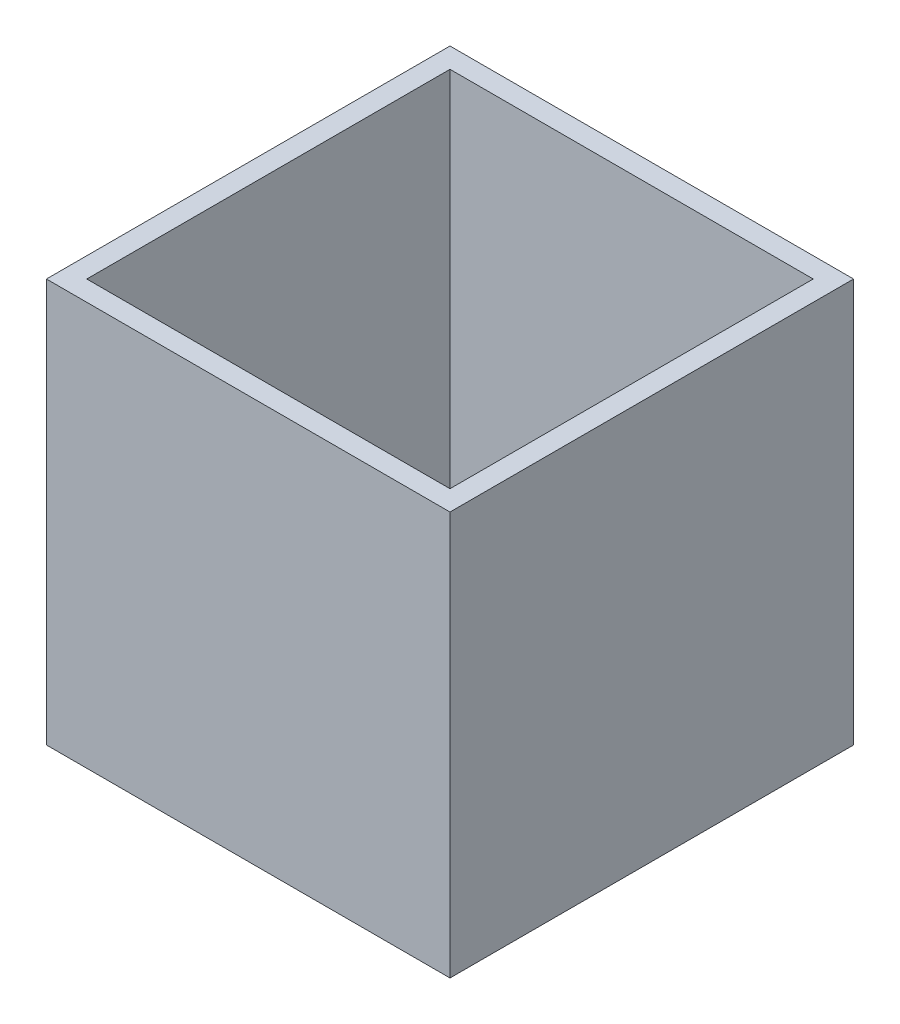
ISO-10303-21;
HEADER;
FILE_DESCRIPTION(('STEP AP214'),'2;1');
FILE_NAME('part.step','',(''),(''),'','','');
FILE_SCHEMA(('AUTOMOTIVE_DESIGN { 1 0 10303 214 1 1 1 1 }'));
ENDSEC;
DATA;
#1=APPLICATION_CONTEXT('core data for automotive mechanical design processes');
#2=APPLICATION_PROTOCOL_DEFINITION('international standard','automotive_design',2000,#1);
#3=PRODUCT_CONTEXT('',#1,'mechanical');
#4=PRODUCT('Part','Part','',(#3));
#5=PRODUCT_RELATED_PRODUCT_CATEGORY('part','',(#4));
#6=PRODUCT_DEFINITION_FORMATION('','',#4);
#7=PRODUCT_DEFINITION_CONTEXT('part definition',#1,'design');
#8=PRODUCT_DEFINITION('design','',#6,#7);
#9=PRODUCT_DEFINITION_SHAPE('','',#8);
#10=(LENGTH_UNIT() NAMED_UNIT(*) SI_UNIT(.MILLI.,.METRE.));
#11=(NAMED_UNIT(*) PLANE_ANGLE_UNIT() SI_UNIT($,.RADIAN.));
#12=(NAMED_UNIT(*) SI_UNIT($,.STERADIAN.) SOLID_ANGLE_UNIT());
#13=UNCERTAINTY_MEASURE_WITH_UNIT(LENGTH_MEASURE(1.E-05),#10,'distance_accuracy_value','');
#14=(GEOMETRIC_REPRESENTATION_CONTEXT(3) GLOBAL_UNCERTAINTY_ASSIGNED_CONTEXT((#13)) GLOBAL_UNIT_ASSIGNED_CONTEXT((#10,
#11,#12)) REPRESENTATION_CONTEXT('',''));
#15=CARTESIAN_POINT('',(0.,0.,0.));
#16=DIRECTION('',(0.,0.,1.));
#17=DIRECTION('',(1.,0.,0.));
#18=AXIS2_PLACEMENT_3D('',#15,#16,#17);
#19=CARTESIAN_POINT('',(0.,40.,0.));
#20=DIRECTION('',(0.,1.,0.));
#21=DIRECTION('',(0.,0.,1.));
#22=AXIS2_PLACEMENT_3D('',#19,#20,#21);
#23=PLANE('',#22);
#24=DIRECTION('',(0.,0.,1.));
#25=VECTOR('',#24,1.);
#26=CARTESIAN_POINT('',(-20.,40.,20.));
#27=LINE('',#26,#25);
#28=CARTESIAN_POINT('',(-20.,40.,-20.));
#29=VERTEX_POINT('',#28);
#30=CARTESIAN_POINT('',(-20.,40.,20.));
#31=VERTEX_POINT('',#30);
#32=EDGE_CURVE('E195',#29,#31,#27,.T.);
#33=ORIENTED_EDGE('',*,*,#32,.T.);
#34=DIRECTION('',(1.,0.,0.));
#35=VECTOR('',#34,1.);
#36=CARTESIAN_POINT('',(20.,40.,20.));
#37=LINE('',#36,#35);
#38=CARTESIAN_POINT('',(20.,40.,20.));
#39=VERTEX_POINT('',#38);
#40=EDGE_CURVE('E199',#31,#39,#37,.T.);
#41=ORIENTED_EDGE('',*,*,#40,.T.);
#42=DIRECTION('',(0.,0.,-1.));
#43=VECTOR('',#42,1.);
#44=CARTESIAN_POINT('',(20.,40.,20.));
#45=LINE('',#44,#43);
#46=CARTESIAN_POINT('',(20.,40.,-20.));
#47=VERTEX_POINT('',#46);
#48=EDGE_CURVE('E203',#39,#47,#45,.T.);
#49=ORIENTED_EDGE('',*,*,#48,.T.);
#50=DIRECTION('',(-1.,0.,0.));
#51=VECTOR('',#50,1.);
#52=CARTESIAN_POINT('',(20.,40.,-20.));
#53=LINE('',#52,#51);
#54=EDGE_CURVE('E206',#47,#29,#53,.T.);
#55=ORIENTED_EDGE('',*,*,#54,.T.);
#56=EDGE_LOOP('',(#33,#41,#49,#55));
#57=FACE_BOUND('',#56,.T.);
#58=DIRECTION('',(1.,0.,0.));
#59=VECTOR('',#58,1.);
#60=CARTESIAN_POINT('',(20.,40.,18.));
#61=LINE('',#60,#59);
#62=CARTESIAN_POINT('',(-18.,40.,18.));
#63=VERTEX_POINT('',#62);
#64=CARTESIAN_POINT('',(18.,40.,18.));
#65=VERTEX_POINT('',#64);
#66=EDGE_CURVE('E156',#63,#65,#61,.T.);
#67=ORIENTED_EDGE('',*,*,#66,.F.);
#68=DIRECTION('',(0.,0.,1.));
#69=VECTOR('',#68,1.);
#70=CARTESIAN_POINT('',(-18.,40.,20.));
#71=LINE('',#70,#69);
#72=CARTESIAN_POINT('',(-18.,40.,-18.));
#73=VERTEX_POINT('',#72);
#74=EDGE_CURVE('E147',#73,#63,#71,.T.);
#75=ORIENTED_EDGE('',*,*,#74,.F.);
#76=DIRECTION('',(-1.,0.,0.));
#77=VECTOR('',#76,1.);
#78=CARTESIAN_POINT('',(20.,40.,-18.));
#79=LINE('',#78,#77);
#80=CARTESIAN_POINT('',(18.,40.,-18.));
#81=VERTEX_POINT('',#80);
#82=EDGE_CURVE('E174',#81,#73,#79,.T.);
#83=ORIENTED_EDGE('',*,*,#82,.F.);
#84=DIRECTION('',(0.,0.,-1.));
#85=VECTOR('',#84,1.);
#86=CARTESIAN_POINT('',(18.,40.,20.));
#87=LINE('',#86,#85);
#88=EDGE_CURVE('E169',#65,#81,#87,.T.);
#89=ORIENTED_EDGE('',*,*,#88,.F.);
#90=EDGE_LOOP('',(#67,#75,#83,#89));
#91=FACE_BOUND('',#90,.T.);
#92=ADVANCED_FACE('F65',(#57,#91),#23,.T.);
#93=CARTESIAN_POINT('',(0.,0.,0.));
#94=DIRECTION('',(0.,1.,0.));
#95=DIRECTION('',(0.,0.,1.));
#96=AXIS2_PLACEMENT_3D('',#93,#94,#95);
#97=PLANE('',#96);
#98=DIRECTION('',(0.,0.,1.));
#99=VECTOR('',#98,1.);
#100=CARTESIAN_POINT('',(-20.,0.,20.));
#101=LINE('',#100,#99);
#102=CARTESIAN_POINT('',(-20.,0.,-20.));
#103=VERTEX_POINT('',#102);
#104=CARTESIAN_POINT('',(-20.,0.,20.));
#105=VERTEX_POINT('',#104);
#106=EDGE_CURVE('E165',#103,#105,#101,.T.);
#107=ORIENTED_EDGE('',*,*,#106,.F.);
#108=DIRECTION('',(-1.,0.,0.));
#109=VECTOR('',#108,1.);
#110=CARTESIAN_POINT('',(20.,0.,-20.));
#111=LINE('',#110,#109);
#112=CARTESIAN_POINT('',(20.,0.,-20.));
#113=VERTEX_POINT('',#112);
#114=EDGE_CURVE('E200',#113,#103,#111,.T.);
#115=ORIENTED_EDGE('',*,*,#114,.F.);
#116=DIRECTION('',(0.,0.,-1.));
#117=VECTOR('',#116,1.);
#118=CARTESIAN_POINT('',(20.,0.,20.));
#119=LINE('',#118,#117);
#120=CARTESIAN_POINT('',(20.,0.,20.));
#121=VERTEX_POINT('',#120);
#122=EDGE_CURVE('E216',#121,#113,#119,.T.);
#123=ORIENTED_EDGE('',*,*,#122,.F.);
#124=DIRECTION('',(1.,0.,0.));
#125=VECTOR('',#124,1.);
#126=CARTESIAN_POINT('',(20.,0.,20.));
#127=LINE('',#126,#125);
#128=EDGE_CURVE('E213',#105,#121,#127,.T.);
#129=ORIENTED_EDGE('',*,*,#128,.F.);
#130=EDGE_LOOP('',(#107,#115,#123,#129));
#131=FACE_BOUND('',#130,.T.);
#132=DIRECTION('',(0.,0.,1.));
#133=VECTOR('',#132,1.);
#134=CARTESIAN_POINT('',(-18.,0.,20.));
#135=LINE('',#134,#133);
#136=CARTESIAN_POINT('',(-18.,0.,-18.));
#137=VERTEX_POINT('',#136);
#138=CARTESIAN_POINT('',(-18.,0.,18.));
#139=VERTEX_POINT('',#138);
#140=EDGE_CURVE('E94',#137,#139,#135,.T.);
#141=ORIENTED_EDGE('',*,*,#140,.T.);
#142=DIRECTION('',(1.,0.,0.));
#143=VECTOR('',#142,1.);
#144=CARTESIAN_POINT('',(20.,0.,18.));
#145=LINE('',#144,#143);
#146=CARTESIAN_POINT('',(18.,0.,18.));
#147=VERTEX_POINT('',#146);
#148=EDGE_CURVE('E163',#139,#147,#145,.T.);
#149=ORIENTED_EDGE('',*,*,#148,.T.);
#150=DIRECTION('',(0.,0.,-1.));
#151=VECTOR('',#150,1.);
#152=CARTESIAN_POINT('',(18.,0.,20.));
#153=LINE('',#152,#151);
#154=CARTESIAN_POINT('',(18.,0.,-18.));
#155=VERTEX_POINT('',#154);
#156=EDGE_CURVE('E182',#147,#155,#153,.T.);
#157=ORIENTED_EDGE('',*,*,#156,.T.);
#158=DIRECTION('',(-1.,0.,0.));
#159=VECTOR('',#158,1.);
#160=CARTESIAN_POINT('',(20.,0.,-18.));
#161=LINE('',#160,#159);
#162=EDGE_CURVE('E157',#155,#137,#161,.T.);
#163=ORIENTED_EDGE('',*,*,#162,.T.);
#164=EDGE_LOOP('',(#141,#149,#157,#163));
#165=FACE_BOUND('',#164,.T.);
#166=ADVANCED_FACE('F239',(#131,#165),#97,.F.);
#167=CARTESIAN_POINT('',(-20.,40.,20.));
#168=DIRECTION('',(1.,0.,0.));
#169=DIRECTION('',(0.,0.,-1.));
#170=AXIS2_PLACEMENT_3D('',#167,#168,#169);
#171=PLANE('',#170);
#172=ORIENTED_EDGE('',*,*,#106,.T.);
#173=DIRECTION('',(0.,-1.,0.));
#174=VECTOR('',#173,1.);
#175=CARTESIAN_POINT('',(-20.,40.,20.));
#176=LINE('',#175,#174);
#177=EDGE_CURVE('E12',#31,#105,#176,.T.);
#178=ORIENTED_EDGE('',*,*,#177,.F.);
#179=ORIENTED_EDGE('',*,*,#32,.F.);
#180=DIRECTION('',(0.,-1.,0.));
#181=VECTOR('',#180,1.);
#182=CARTESIAN_POINT('',(-20.,40.,-20.));
#183=LINE('',#182,#181);
#184=EDGE_CURVE('E209',#29,#103,#183,.T.);
#185=ORIENTED_EDGE('',*,*,#184,.T.);
#186=EDGE_LOOP('',(#172,#178,#179,#185));
#187=FACE_BOUND('',#186,.T.);
#188=ADVANCED_FACE('F67',(#187),#171,.F.);
#189=CARTESIAN_POINT('',(20.,40.,20.));
#190=DIRECTION('',(0.,0.,-1.));
#191=DIRECTION('',(-1.,0.,0.));
#192=AXIS2_PLACEMENT_3D('',#189,#190,#191);
#193=PLANE('',#192);
#194=ORIENTED_EDGE('',*,*,#128,.T.);
#195=DIRECTION('',(0.,-1.,0.));
#196=VECTOR('',#195,1.);
#197=CARTESIAN_POINT('',(20.,40.,20.));
#198=LINE('',#197,#196);
#199=EDGE_CURVE('E74',#39,#121,#198,.T.);
#200=ORIENTED_EDGE('',*,*,#199,.F.);
#201=ORIENTED_EDGE('',*,*,#40,.F.);
#202=ORIENTED_EDGE('',*,*,#177,.T.);
#203=EDGE_LOOP('',(#194,#200,#201,#202));
#204=FACE_BOUND('',#203,.T.);
#205=ADVANCED_FACE('F249',(#204),#193,.F.);
#206=CARTESIAN_POINT('',(20.,40.,20.));
#207=DIRECTION('',(-1.,0.,0.));
#208=DIRECTION('',(0.,0.,1.));
#209=AXIS2_PLACEMENT_3D('',#206,#207,#208);
#210=PLANE('',#209);
#211=ORIENTED_EDGE('',*,*,#122,.T.);
#212=DIRECTION('',(0.,-1.,0.));
#213=VECTOR('',#212,1.);
#214=CARTESIAN_POINT('',(20.,40.,-20.));
#215=LINE('',#214,#213);
#216=EDGE_CURVE('E224',#47,#113,#215,.T.);
#217=ORIENTED_EDGE('',*,*,#216,.F.);
#218=ORIENTED_EDGE('',*,*,#48,.F.);
#219=ORIENTED_EDGE('',*,*,#199,.T.);
#220=EDGE_LOOP('',(#211,#217,#218,#219));
#221=FACE_BOUND('',#220,.T.);
#222=ADVANCED_FACE('F233',(#221),#210,.F.);
#223=CARTESIAN_POINT('',(20.,40.,-20.));
#224=DIRECTION('',(0.,0.,1.));
#225=DIRECTION('',(1.,0.,0.));
#226=AXIS2_PLACEMENT_3D('',#223,#224,#225);
#227=PLANE('',#226);
#228=ORIENTED_EDGE('',*,*,#114,.T.);
#229=ORIENTED_EDGE('',*,*,#184,.F.);
#230=ORIENTED_EDGE('',*,*,#54,.F.);
#231=ORIENTED_EDGE('',*,*,#216,.T.);
#232=EDGE_LOOP('',(#228,#229,#230,#231));
#233=FACE_BOUND('',#232,.T.);
#234=ADVANCED_FACE('F243',(#233),#227,.F.);
#235=CARTESIAN_POINT('',(-18.,40.,20.));
#236=DIRECTION('',(1.,0.,0.));
#237=DIRECTION('',(0.,0.,-1.));
#238=AXIS2_PLACEMENT_3D('',#235,#236,#237);
#239=PLANE('',#238);
#240=ORIENTED_EDGE('',*,*,#140,.F.);
#241=DIRECTION('',(0.,-1.,0.));
#242=VECTOR('',#241,1.);
#243=CARTESIAN_POINT('',(-18.,40.,-18.));
#244=LINE('',#243,#242);
#245=EDGE_CURVE('E151',#73,#137,#244,.T.);
#246=ORIENTED_EDGE('',*,*,#245,.F.);
#247=ORIENTED_EDGE('',*,*,#74,.T.);
#248=DIRECTION('',(0.,-1.,0.));
#249=VECTOR('',#248,1.);
#250=CARTESIAN_POINT('',(-18.,40.,18.));
#251=LINE('',#250,#249);
#252=EDGE_CURVE('E150',#63,#139,#251,.T.);
#253=ORIENTED_EDGE('',*,*,#252,.T.);
#254=EDGE_LOOP('',(#240,#246,#247,#253));
#255=FACE_BOUND('',#254,.T.);
#256=ADVANCED_FACE('F149',(#255),#239,.T.);
#257=CARTESIAN_POINT('',(20.,40.,18.));
#258=DIRECTION('',(0.,0.,-1.));
#259=DIRECTION('',(-1.,0.,0.));
#260=AXIS2_PLACEMENT_3D('',#257,#258,#259);
#261=PLANE('',#260);
#262=ORIENTED_EDGE('',*,*,#148,.F.);
#263=ORIENTED_EDGE('',*,*,#252,.F.);
#264=ORIENTED_EDGE('',*,*,#66,.T.);
#265=DIRECTION('',(0.,-1.,0.));
#266=VECTOR('',#265,1.);
#267=CARTESIAN_POINT('',(18.,40.,18.));
#268=LINE('',#267,#266);
#269=EDGE_CURVE('E166',#65,#147,#268,.T.);
#270=ORIENTED_EDGE('',*,*,#269,.T.);
#271=EDGE_LOOP('',(#262,#263,#264,#270));
#272=FACE_BOUND('',#271,.T.);
#273=ADVANCED_FACE('F160',(#272),#261,.T.);
#274=CARTESIAN_POINT('',(18.,40.,20.));
#275=DIRECTION('',(-1.,0.,0.));
#276=DIRECTION('',(0.,0.,1.));
#277=AXIS2_PLACEMENT_3D('',#274,#275,#276);
#278=PLANE('',#277);
#279=ORIENTED_EDGE('',*,*,#156,.F.);
#280=ORIENTED_EDGE('',*,*,#269,.F.);
#281=ORIENTED_EDGE('',*,*,#88,.T.);
#282=DIRECTION('',(0.,-1.,0.));
#283=VECTOR('',#282,1.);
#284=CARTESIAN_POINT('',(18.,40.,-18.));
#285=LINE('',#284,#283);
#286=EDGE_CURVE('E84',#81,#155,#285,.T.);
#287=ORIENTED_EDGE('',*,*,#286,.T.);
#288=EDGE_LOOP('',(#279,#280,#281,#287));
#289=FACE_BOUND('',#288,.T.);
#290=ADVANCED_FACE('F272',(#289),#278,.T.);
#291=CARTESIAN_POINT('',(20.,40.,-18.));
#292=DIRECTION('',(0.,0.,1.));
#293=DIRECTION('',(1.,0.,0.));
#294=AXIS2_PLACEMENT_3D('',#291,#292,#293);
#295=PLANE('',#294);
#296=ORIENTED_EDGE('',*,*,#162,.F.);
#297=ORIENTED_EDGE('',*,*,#286,.F.);
#298=ORIENTED_EDGE('',*,*,#82,.T.);
#299=ORIENTED_EDGE('',*,*,#245,.T.);
#300=EDGE_LOOP('',(#296,#297,#298,#299));
#301=FACE_BOUND('',#300,.T.);
#302=ADVANCED_FACE('F276',(#301),#295,.T.);
#303=CLOSED_SHELL('',(#92,#166,#188,#205,#222,#234,#256,#273,#290,#302));
#304=MANIFOLD_SOLID_BREP('B2',#303);
#305=ADVANCED_BREP_SHAPE_REPRESENTATION('',(#18,#304),#14);
#306=SHAPE_DEFINITION_REPRESENTATION(#9,#305);
ENDSEC;
END-ISO-10303-21;
